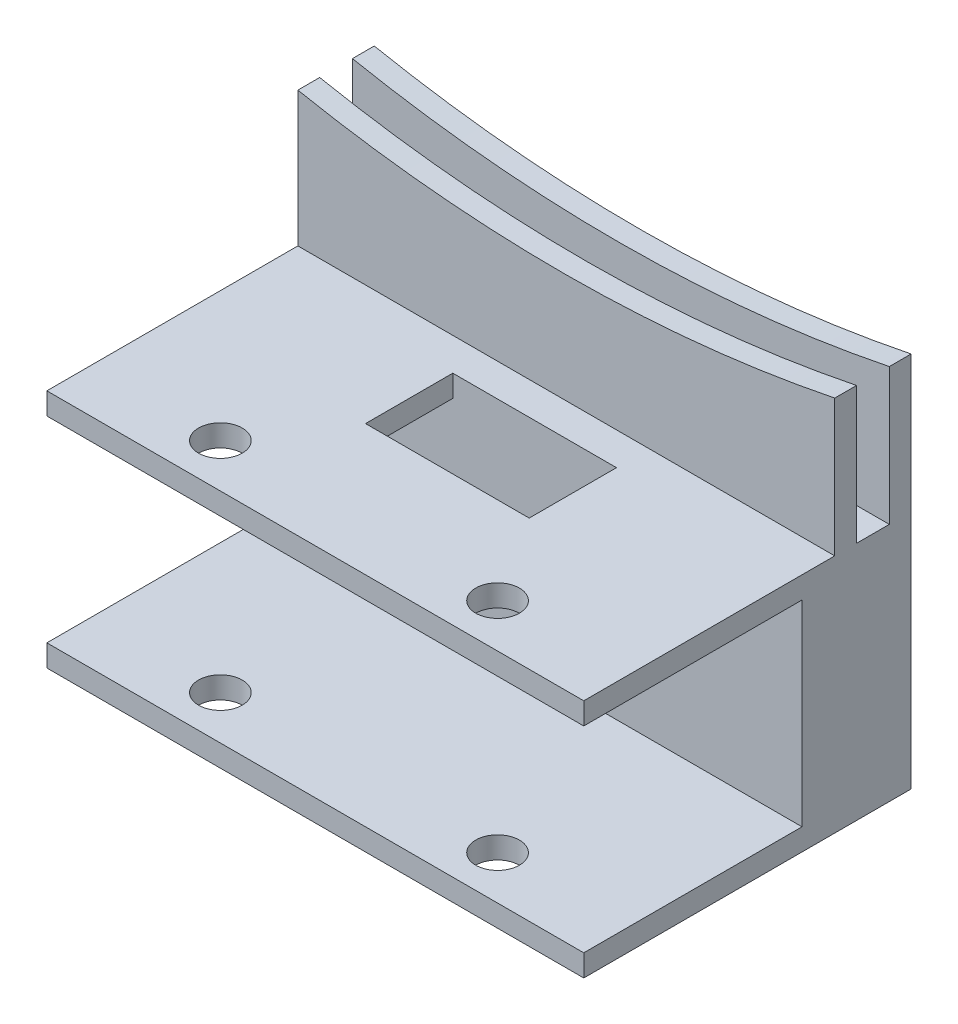
ISO-10303-21;
HEADER;
FILE_DESCRIPTION(('STEP AP214'),'2;1');
FILE_NAME('part.step','',(''),(''),'','','');
FILE_SCHEMA(('AUTOMOTIVE_DESIGN { 1 0 10303 214 1 1 1 1 }'));
ENDSEC;
DATA;
#1=APPLICATION_CONTEXT('core data for automotive mechanical design processes');
#2=APPLICATION_PROTOCOL_DEFINITION('international standard','automotive_design',2000,#1);
#3=PRODUCT_CONTEXT('',#1,'mechanical');
#4=PRODUCT('Part','Part','',(#3));
#5=PRODUCT_RELATED_PRODUCT_CATEGORY('part','',(#4));
#6=PRODUCT_DEFINITION_FORMATION('','',#4);
#7=PRODUCT_DEFINITION_CONTEXT('part definition',#1,'design');
#8=PRODUCT_DEFINITION('design','',#6,#7);
#9=PRODUCT_DEFINITION_SHAPE('','',#8);
#10=(LENGTH_UNIT() NAMED_UNIT(*) SI_UNIT(.MILLI.,.METRE.));
#11=(NAMED_UNIT(*) PLANE_ANGLE_UNIT() SI_UNIT($,.RADIAN.));
#12=(NAMED_UNIT(*) SI_UNIT($,.STERADIAN.) SOLID_ANGLE_UNIT());
#13=UNCERTAINTY_MEASURE_WITH_UNIT(LENGTH_MEASURE(1.E-05),#10,'distance_accuracy_value','');
#14=(GEOMETRIC_REPRESENTATION_CONTEXT(3) GLOBAL_UNCERTAINTY_ASSIGNED_CONTEXT((#13)) GLOBAL_UNIT_ASSIGNED_CONTEXT((#10,
#11,#12)) REPRESENTATION_CONTEXT('',''));
#15=CARTESIAN_POINT('',(0.,0.,0.));
#16=DIRECTION('',(0.,0.,1.));
#17=DIRECTION('',(1.,0.,0.));
#18=AXIS2_PLACEMENT_3D('',#15,#16,#17);
#19=CARTESIAN_POINT('',(-23.6243421052632,22.,9.85197368421053));
#20=DIRECTION('',(0.,0.,-1.));
#21=DIRECTION('',(-1.,0.,0.));
#22=AXIS2_PLACEMENT_3D('',#19,#20,#21);
#23=PLANE('',#22);
#24=DIRECTION('',(0.,-1.,0.));
#25=VECTOR('',#24,1.);
#26=CARTESIAN_POINT('',(25.5756578947368,22.,9.85197368421053));
#27=LINE('',#26,#25);
#28=CARTESIAN_POINT('',(25.5756578947368,2.,9.85197368421053));
#29=VERTEX_POINT('',#28);
#30=CARTESIAN_POINT('',(25.5756578947368,0.,9.85197368421053));
#31=VERTEX_POINT('',#30);
#32=EDGE_CURVE('E245',#29,#31,#27,.T.);
#33=ORIENTED_EDGE('',*,*,#32,.F.);
#34=DIRECTION('',(-1.,0.,0.));
#35=VECTOR('',#34,1.);
#36=CARTESIAN_POINT('',(-23.6243421052632,2.,9.85197368421053));
#37=LINE('',#36,#35);
#38=CARTESIAN_POINT('',(-23.6243421052632,2.,9.85197368421053));
#39=VERTEX_POINT('',#38);
#40=EDGE_CURVE('E11',#29,#39,#37,.T.);
#41=ORIENTED_EDGE('',*,*,#40,.T.);
#42=DIRECTION('',(0.,-1.,0.));
#43=VECTOR('',#42,1.);
#44=CARTESIAN_POINT('',(-23.6243421052632,22.,9.85197368421053));
#45=LINE('',#44,#43);
#46=CARTESIAN_POINT('',(-23.6243421052632,0.,9.85197368421053));
#47=VERTEX_POINT('',#46);
#48=EDGE_CURVE('E260',#39,#47,#45,.T.);
#49=ORIENTED_EDGE('',*,*,#48,.T.);
#50=DIRECTION('',(1.,0.,0.));
#51=VECTOR('',#50,1.);
#52=CARTESIAN_POINT('',(-23.6243421052632,0.,9.85197368421053));
#53=LINE('',#52,#51);
#54=EDGE_CURVE('E254',#47,#31,#53,.T.);
#55=ORIENTED_EDGE('',*,*,#54,.T.);
#56=EDGE_LOOP('',(#33,#41,#49,#55));
#57=FACE_BOUND('',#56,.T.);
#58=ADVANCED_FACE('F33',(#57),#23,.F.);
#59=CARTESIAN_POINT('',(0.,22.,0.));
#60=DIRECTION('',(0.,1.,0.));
#61=DIRECTION('',(0.,0.,1.));
#62=AXIS2_PLACEMENT_3D('',#59,#60,#61);
#63=PLANE('',#62);
#64=DIRECTION('',(0.,0.,1.));
#65=VECTOR('',#64,1.);
#66=CARTESIAN_POINT('',(-23.6243421052632,22.,-20.1480263157895));
#67=LINE('',#66,#65);
#68=CARTESIAN_POINT('',(-23.6243421052632,22.,-18.1480263157895));
#69=VERTEX_POINT('',#68);
#70=CARTESIAN_POINT('',(-23.6243421052632,22.,-15.1480263157895));
#71=VERTEX_POINT('',#70);
#72=EDGE_CURVE('E240',#69,#71,#67,.T.);
#73=ORIENTED_EDGE('',*,*,#72,.T.);
#74=DIRECTION('',(-1.,0.,0.));
#75=VECTOR('',#74,1.);
#76=CARTESIAN_POINT('',(25.5756578947368,22.,-15.1480263157895));
#77=LINE('',#76,#75);
#78=CARTESIAN_POINT('',(25.5756578947368,22.,-15.1480263157895));
#79=VERTEX_POINT('',#78);
#80=EDGE_CURVE('E213',#79,#71,#77,.T.);
#81=ORIENTED_EDGE('',*,*,#80,.F.);
#82=DIRECTION('',(0.,0.,-1.));
#83=VECTOR('',#82,1.);
#84=CARTESIAN_POINT('',(25.5756578947368,22.,-20.1480263157895));
#85=LINE('',#84,#83);
#86=CARTESIAN_POINT('',(25.5756578947368,22.,-18.1480263157895));
#87=VERTEX_POINT('',#86);
#88=EDGE_CURVE('E239',#79,#87,#85,.T.);
#89=ORIENTED_EDGE('',*,*,#88,.T.);
#90=DIRECTION('',(1.,0.,0.));
#91=VECTOR('',#90,1.);
#92=CARTESIAN_POINT('',(-23.6243421052632,22.,-18.1480263157895));
#93=LINE('',#92,#91);
#94=EDGE_CURVE('E227',#69,#87,#93,.T.);
#95=ORIENTED_EDGE('',*,*,#94,.F.);
#96=EDGE_LOOP('',(#73,#81,#89,#95));
#97=FACE_BOUND('',#96,.T.);
#98=ADVANCED_FACE('F340',(#97),#63,.T.);
#99=DIRECTION('',(0.,0.,-1.));
#100=VECTOR('',#99,1.);
#101=CARTESIAN_POINT('',(8.57565789473683,22.,-2.14802631578947));
#102=LINE('',#101,#100);
#103=CARTESIAN_POINT('',(8.57565789473683,22.,-2.14802631578947));
#104=VERTEX_POINT('',#103);
#105=CARTESIAN_POINT('',(8.57565789473683,22.,-10.1480263157895));
#106=VERTEX_POINT('',#105);
#107=EDGE_CURVE('E50',#104,#106,#102,.T.);
#108=ORIENTED_EDGE('',*,*,#107,.F.);
#109=DIRECTION('',(1.,0.,0.));
#110=VECTOR('',#109,1.);
#111=CARTESIAN_POINT('',(8.57565789473683,22.,-2.14802631578947));
#112=LINE('',#111,#110);
#113=CARTESIAN_POINT('',(-6.42434210526317,22.,-2.14802631578947));
#114=VERTEX_POINT('',#113);
#115=EDGE_CURVE('E176',#114,#104,#112,.T.);
#116=ORIENTED_EDGE('',*,*,#115,.F.);
#117=DIRECTION('',(0.,0.,1.));
#118=VECTOR('',#117,1.);
#119=CARTESIAN_POINT('',(-6.42434210526317,22.,-2.14802631578947));
#120=LINE('',#119,#118);
#121=CARTESIAN_POINT('',(-6.42434210526317,22.,-10.1480263157895));
#122=VERTEX_POINT('',#121);
#123=EDGE_CURVE('E418',#122,#114,#120,.T.);
#124=ORIENTED_EDGE('',*,*,#123,.F.);
#125=DIRECTION('',(-1.,0.,0.));
#126=VECTOR('',#125,1.);
#127=CARTESIAN_POINT('',(8.57565789473683,22.,-10.1480263157895));
#128=LINE('',#127,#126);
#129=EDGE_CURVE('E421',#106,#122,#128,.T.);
#130=ORIENTED_EDGE('',*,*,#129,.F.);
#131=EDGE_LOOP('',(#108,#116,#124,#130));
#132=FACE_BOUND('',#131,.T.);
#133=CARTESIAN_POINT('',(-11.7243421052632,22.,5.85197368421052));
#134=DIRECTION('',(0.,-1.,0.));
#135=DIRECTION('',(0.,0.,-1.));
#136=AXIS2_PLACEMENT_3D('',#133,#134,#135);
#137=CIRCLE('',#136,2.);
#138=CARTESIAN_POINT('',(-11.7243421052632,22.,3.85197368421053));
#139=VERTEX_POINT('',#138);
#140=EDGE_CURVE('E432',#139,#139,#137,.T.);
#141=ORIENTED_EDGE('',*,*,#140,.T.);
#142=EDGE_LOOP('',(#141));
#143=FACE_BOUND('',#142,.T.);
#144=CARTESIAN_POINT('',(13.6756578947368,22.,5.85197368421052));
#145=DIRECTION('',(0.,-1.,0.));
#146=DIRECTION('',(0.,0.,-1.));
#147=AXIS2_PLACEMENT_3D('',#144,#145,#146);
#148=CIRCLE('',#147,2.);
#149=CARTESIAN_POINT('',(13.6756578947368,22.,3.85197368421052));
#150=VERTEX_POINT('',#149);
#151=EDGE_CURVE('E272',#150,#150,#148,.T.);
#152=ORIENTED_EDGE('',*,*,#151,.T.);
#153=EDGE_LOOP('',(#152));
#154=FACE_BOUND('',#153,.T.);
#155=CARTESIAN_POINT('',(25.5756578947368,22.,9.85197368421053));
#156=VERTEX_POINT('',#155);
#157=CARTESIAN_POINT('',(25.5756578947368,22.,-13.1480263157895));
#158=VERTEX_POINT('',#157);
#159=EDGE_CURVE('E235',#156,#158,#85,.T.);
#160=ORIENTED_EDGE('',*,*,#159,.T.);
#161=DIRECTION('',(1.,0.,0.));
#162=VECTOR('',#161,1.);
#163=CARTESIAN_POINT('',(25.5756578947368,22.,-13.1480263157895));
#164=LINE('',#163,#162);
#165=CARTESIAN_POINT('',(-23.6243421052632,22.,-13.1480263157895));
#166=VERTEX_POINT('',#165);
#167=EDGE_CURVE('E216',#166,#158,#164,.T.);
#168=ORIENTED_EDGE('',*,*,#167,.F.);
#169=CARTESIAN_POINT('',(-23.6243421052632,22.,9.85197368421053));
#170=VERTEX_POINT('',#169);
#171=EDGE_CURVE('E238',#166,#170,#67,.T.);
#172=ORIENTED_EDGE('',*,*,#171,.T.);
#173=DIRECTION('',(1.,0.,0.));
#174=VECTOR('',#173,1.);
#175=CARTESIAN_POINT('',(-23.6243421052632,22.,9.85197368421053));
#176=LINE('',#175,#174);
#177=EDGE_CURVE('E243',#170,#156,#176,.T.);
#178=ORIENTED_EDGE('',*,*,#177,.T.);
#179=EDGE_LOOP('',(#160,#168,#172,#178));
#180=FACE_BOUND('',#179,.T.);
#181=ADVANCED_FACE('F323',(#132,#143,#154,#180),#63,.T.);
#182=CARTESIAN_POINT('',(25.5756578947368,22.,-20.1480263157895));
#183=DIRECTION('',(-1.,0.,0.));
#184=DIRECTION('',(0.,0.,1.));
#185=AXIS2_PLACEMENT_3D('',#182,#183,#184);
#186=PLANE('',#185);
#187=DIRECTION('',(0.,-1.,0.));
#188=VECTOR('',#187,1.);
#189=CARTESIAN_POINT('',(25.5756578947368,22.,-10.1480263157895));
#190=LINE('',#189,#188);
#191=CARTESIAN_POINT('',(25.5756578947368,20.,-10.1480263157895));
#192=VERTEX_POINT('',#191);
#193=CARTESIAN_POINT('',(25.5756578947368,2.,-10.1480263157895));
#194=VERTEX_POINT('',#193);
#195=EDGE_CURVE('E181',#192,#194,#190,.T.);
#196=ORIENTED_EDGE('',*,*,#195,.T.);
#197=DIRECTION('',(0.,0.,1.));
#198=VECTOR('',#197,1.);
#199=CARTESIAN_POINT('',(25.5756578947368,2.,-20.1480263157895));
#200=LINE('',#199,#198);
#201=EDGE_CURVE('E191',#194,#29,#200,.T.);
#202=ORIENTED_EDGE('',*,*,#201,.T.);
#203=ORIENTED_EDGE('',*,*,#32,.T.);
#204=DIRECTION('',(0.,0.,-1.));
#205=VECTOR('',#204,1.);
#206=CARTESIAN_POINT('',(25.5756578947368,0.,-20.1480263157895));
#207=LINE('',#206,#205);
#208=CARTESIAN_POINT('',(25.5756578947368,0.,-20.1480263157895));
#209=VERTEX_POINT('',#208);
#210=EDGE_CURVE('E234',#31,#209,#207,.T.);
#211=ORIENTED_EDGE('',*,*,#210,.T.);
#212=DIRECTION('',(0.,-1.,0.));
#213=VECTOR('',#212,1.);
#214=CARTESIAN_POINT('',(25.5756578947368,22.,-20.1480263157895));
#215=LINE('',#214,#213);
#216=CARTESIAN_POINT('',(25.5756578947368,34.5255128608411,-20.1480263157895));
#217=VERTEX_POINT('',#216);
#218=EDGE_CURVE('E266',#217,#209,#215,.T.);
#219=ORIENTED_EDGE('',*,*,#218,.F.);
#220=DIRECTION('',(0.,0.,-1.));
#221=VECTOR('',#220,1.);
#222=CARTESIAN_POINT('',(25.5756578947368,34.5255128608411,-13.1480263157895));
#223=LINE('',#222,#221);
#224=CARTESIAN_POINT('',(25.5756578947368,34.5255128608411,-18.1480263157895));
#225=VERTEX_POINT('',#224);
#226=EDGE_CURVE('E204',#225,#217,#223,.T.);
#227=ORIENTED_EDGE('',*,*,#226,.F.);
#228=DIRECTION('',(0.,-1.,0.));
#229=VECTOR('',#228,1.);
#230=CARTESIAN_POINT('',(25.5756578947368,42.,-18.1480263157895));
#231=LINE('',#230,#229);
#232=EDGE_CURVE('E230',#225,#87,#231,.T.);
#233=ORIENTED_EDGE('',*,*,#232,.T.);
#234=ORIENTED_EDGE('',*,*,#88,.F.);
#235=DIRECTION('',(0.,-1.,0.));
#236=VECTOR('',#235,1.);
#237=CARTESIAN_POINT('',(25.5756578947368,42.,-15.1480263157895));
#238=LINE('',#237,#236);
#239=CARTESIAN_POINT('',(25.5756578947368,34.5255128608411,-15.1480263157895));
#240=VERTEX_POINT('',#239);
#241=EDGE_CURVE('E225',#240,#79,#238,.T.);
#242=ORIENTED_EDGE('',*,*,#241,.F.);
#243=CARTESIAN_POINT('',(25.5756578947368,34.5255128608411,-13.1480263157895));
#244=VERTEX_POINT('',#243);
#245=EDGE_CURVE('E201',#244,#240,#223,.T.);
#246=ORIENTED_EDGE('',*,*,#245,.F.);
#247=DIRECTION('',(0.,-1.,0.));
#248=VECTOR('',#247,1.);
#249=CARTESIAN_POINT('',(25.5756578947368,42.,-13.1480263157895));
#250=LINE('',#249,#248);
#251=EDGE_CURVE('E219',#244,#158,#250,.T.);
#252=ORIENTED_EDGE('',*,*,#251,.T.);
#253=ORIENTED_EDGE('',*,*,#159,.F.);
#254=CARTESIAN_POINT('',(25.5756578947368,20.,9.85197368421053));
#255=VERTEX_POINT('',#254);
#256=EDGE_CURVE('E257',#156,#255,#27,.T.);
#257=ORIENTED_EDGE('',*,*,#256,.T.);
#258=DIRECTION('',(0.,0.,-1.));
#259=VECTOR('',#258,1.);
#260=CARTESIAN_POINT('',(25.5756578947368,20.,-20.1480263157895));
#261=LINE('',#260,#259);
#262=EDGE_CURVE('E185',#255,#192,#261,.T.);
#263=ORIENTED_EDGE('',*,*,#262,.T.);
#264=EDGE_LOOP('',(#196,#202,#203,#211,#219,#227,#233,#234,#242,#246,#252,#253,#257,#263));
#265=FACE_BOUND('',#264,.T.);
#266=ADVANCED_FACE('F35',(#265),#186,.F.);
#267=CARTESIAN_POINT('',(-23.6243421052632,22.,-20.1480263157895));
#268=DIRECTION('',(0.,0.,1.));
#269=DIRECTION('',(1.,0.,0.));
#270=AXIS2_PLACEMENT_3D('',#267,#268,#269);
#271=PLANE('',#270);
#272=DIRECTION('',(0.,-1.,0.));
#273=VECTOR('',#272,1.);
#274=CARTESIAN_POINT('',(-23.6243421052632,22.,-20.1480263157895));
#275=LINE('',#274,#273);
#276=CARTESIAN_POINT('',(-23.6243421052632,34.3649316060043,-20.1480263157895));
#277=VERTEX_POINT('',#276);
#278=CARTESIAN_POINT('',(-23.6243421052632,0.,-20.1480263157895));
#279=VERTEX_POINT('',#278);
#280=EDGE_CURVE('E264',#277,#279,#275,.T.);
#281=ORIENTED_EDGE('',*,*,#280,.F.);
#282=CARTESIAN_POINT('',(0.57565789473683,157.,-20.1480263157895));
#283=DIRECTION('',(0.,0.,-1.));
#284=DIRECTION('',(1.,0.,0.));
#285=AXIS2_PLACEMENT_3D('',#282,#283,#284);
#286=CIRCLE('',#285,125.);
#287=EDGE_CURVE('E195',#217,#277,#286,.T.);
#288=ORIENTED_EDGE('',*,*,#287,.F.);
#289=ORIENTED_EDGE('',*,*,#218,.T.);
#290=DIRECTION('',(-1.,0.,0.));
#291=VECTOR('',#290,1.);
#292=CARTESIAN_POINT('',(-23.6243421052632,0.,-20.1480263157895));
#293=LINE('',#292,#291);
#294=EDGE_CURVE('E248',#209,#279,#293,.T.);
#295=ORIENTED_EDGE('',*,*,#294,.T.);
#296=EDGE_LOOP('',(#281,#288,#289,#295));
#297=FACE_BOUND('',#296,.T.);
#298=ADVANCED_FACE('F351',(#297),#271,.F.);
#299=CARTESIAN_POINT('',(-23.6243421052632,22.,-20.1480263157895));
#300=DIRECTION('',(1.,0.,0.));
#301=DIRECTION('',(0.,0.,-1.));
#302=AXIS2_PLACEMENT_3D('',#299,#300,#301);
#303=PLANE('',#302);
#304=ORIENTED_EDGE('',*,*,#48,.F.);
#305=DIRECTION('',(0.,0.,1.));
#306=VECTOR('',#305,1.);
#307=CARTESIAN_POINT('',(-23.6243421052632,2.,9.85197368421053));
#308=LINE('',#307,#306);
#309=CARTESIAN_POINT('',(-23.6243421052632,2.,-10.1480263157895));
#310=VERTEX_POINT('',#309);
#311=EDGE_CURVE('E187',#310,#39,#308,.T.);
#312=ORIENTED_EDGE('',*,*,#311,.F.);
#313=DIRECTION('',(0.,-1.,0.));
#314=VECTOR('',#313,1.);
#315=CARTESIAN_POINT('',(-23.6243421052632,2.,-10.1480263157895));
#316=LINE('',#315,#314);
#317=CARTESIAN_POINT('',(-23.6243421052632,20.,-10.1480263157895));
#318=VERTEX_POINT('',#317);
#319=EDGE_CURVE('E291',#318,#310,#316,.T.);
#320=ORIENTED_EDGE('',*,*,#319,.F.);
#321=DIRECTION('',(0.,0.,-1.));
#322=VECTOR('',#321,1.);
#323=CARTESIAN_POINT('',(-23.6243421052632,20.,9.85197368421053));
#324=LINE('',#323,#322);
#325=CARTESIAN_POINT('',(-23.6243421052632,20.,9.85197368421053));
#326=VERTEX_POINT('',#325);
#327=EDGE_CURVE('E276',#326,#318,#324,.T.);
#328=ORIENTED_EDGE('',*,*,#327,.F.);
#329=EDGE_CURVE('E261',#170,#326,#45,.T.);
#330=ORIENTED_EDGE('',*,*,#329,.F.);
#331=ORIENTED_EDGE('',*,*,#171,.F.);
#332=DIRECTION('',(0.,-1.,0.));
#333=VECTOR('',#332,1.);
#334=CARTESIAN_POINT('',(-23.6243421052632,42.,-13.1480263157895));
#335=LINE('',#334,#333);
#336=CARTESIAN_POINT('',(-23.6243421052632,34.3649316060043,-13.1480263157895));
#337=VERTEX_POINT('',#336);
#338=EDGE_CURVE('E221',#337,#166,#335,.T.);
#339=ORIENTED_EDGE('',*,*,#338,.F.);
#340=DIRECTION('',(0.,0.,-1.));
#341=VECTOR('',#340,1.);
#342=CARTESIAN_POINT('',(-23.6243421052632,34.3649316060043,-13.1480263157895));
#343=LINE('',#342,#341);
#344=CARTESIAN_POINT('',(-23.6243421052632,34.3649316060043,-15.1480263157895));
#345=VERTEX_POINT('',#344);
#346=EDGE_CURVE('E205',#337,#345,#343,.T.);
#347=ORIENTED_EDGE('',*,*,#346,.T.);
#348=DIRECTION('',(0.,-1.,0.));
#349=VECTOR('',#348,1.);
#350=CARTESIAN_POINT('',(-23.6243421052632,42.,-15.1480263157895));
#351=LINE('',#350,#349);
#352=EDGE_CURVE('E223',#345,#71,#351,.T.);
#353=ORIENTED_EDGE('',*,*,#352,.T.);
#354=ORIENTED_EDGE('',*,*,#72,.F.);
#355=DIRECTION('',(0.,-1.,0.));
#356=VECTOR('',#355,1.);
#357=CARTESIAN_POINT('',(-23.6243421052632,42.,-18.1480263157895));
#358=LINE('',#357,#356);
#359=CARTESIAN_POINT('',(-23.6243421052632,34.3649316060043,-18.1480263157895));
#360=VERTEX_POINT('',#359);
#361=EDGE_CURVE('E232',#360,#69,#358,.T.);
#362=ORIENTED_EDGE('',*,*,#361,.F.);
#363=EDGE_CURVE('E199',#360,#277,#343,.T.);
#364=ORIENTED_EDGE('',*,*,#363,.T.);
#365=ORIENTED_EDGE('',*,*,#280,.T.);
#366=DIRECTION('',(0.,0.,1.));
#367=VECTOR('',#366,1.);
#368=CARTESIAN_POINT('',(-23.6243421052632,0.,-20.1480263157895));
#369=LINE('',#368,#367);
#370=EDGE_CURVE('E251',#279,#47,#369,.T.);
#371=ORIENTED_EDGE('',*,*,#370,.T.);
#372=EDGE_LOOP('',(#304,#312,#320,#328,#330,#331,#339,#347,#353,#354,#362,#364,#365,#371));
#373=FACE_BOUND('',#372,.T.);
#374=ADVANCED_FACE('F301',(#373),#303,.F.);
#375=ORIENTED_EDGE('',*,*,#329,.T.);
#376=DIRECTION('',(1.,0.,0.));
#377=VECTOR('',#376,1.);
#378=CARTESIAN_POINT('',(-23.6243421052632,20.,9.85197368421053));
#379=LINE('',#378,#377);
#380=EDGE_CURVE('E42',#326,#255,#379,.T.);
#381=ORIENTED_EDGE('',*,*,#380,.T.);
#382=ORIENTED_EDGE('',*,*,#256,.F.);
#383=ORIENTED_EDGE('',*,*,#177,.F.);
#384=EDGE_LOOP('',(#375,#381,#382,#383));
#385=FACE_BOUND('',#384,.T.);
#386=ADVANCED_FACE('F319',(#385),#23,.F.);
#387=CARTESIAN_POINT('',(0.,0.,0.));
#388=DIRECTION('',(0.,1.,0.));
#389=DIRECTION('',(0.,0.,1.));
#390=AXIS2_PLACEMENT_3D('',#387,#388,#389);
#391=PLANE('',#390);
#392=CARTESIAN_POINT('',(-11.7243421052632,0.,5.85197368421052));
#393=DIRECTION('',(0.,-1.,0.));
#394=DIRECTION('',(0.,0.,-1.));
#395=AXIS2_PLACEMENT_3D('',#392,#393,#394);
#396=CIRCLE('',#395,2.);
#397=CARTESIAN_POINT('',(-11.7243421052632,0.,3.85197368421053));
#398=VERTEX_POINT('',#397);
#399=EDGE_CURVE('E429',#398,#398,#396,.T.);
#400=ORIENTED_EDGE('',*,*,#399,.F.);
#401=EDGE_LOOP('',(#400));
#402=FACE_BOUND('',#401,.T.);
#403=CARTESIAN_POINT('',(13.6756578947368,0.,5.85197368421052));
#404=DIRECTION('',(0.,-1.,0.));
#405=DIRECTION('',(0.,0.,-1.));
#406=AXIS2_PLACEMENT_3D('',#403,#404,#405);
#407=CIRCLE('',#406,2.);
#408=CARTESIAN_POINT('',(13.6756578947368,0.,3.85197368421052));
#409=VERTEX_POINT('',#408);
#410=EDGE_CURVE('E279',#409,#409,#407,.T.);
#411=ORIENTED_EDGE('',*,*,#410,.F.);
#412=EDGE_LOOP('',(#411));
#413=FACE_BOUND('',#412,.T.);
#414=ORIENTED_EDGE('',*,*,#210,.F.);
#415=ORIENTED_EDGE('',*,*,#54,.F.);
#416=ORIENTED_EDGE('',*,*,#370,.F.);
#417=ORIENTED_EDGE('',*,*,#294,.F.);
#418=EDGE_LOOP('',(#414,#415,#416,#417));
#419=FACE_BOUND('',#418,.T.);
#420=ADVANCED_FACE('F309',(#402,#413,#419),#391,.F.);
#421=CARTESIAN_POINT('',(-23.6243421052632,42.,-18.1480263157895));
#422=DIRECTION('',(0.,0.,-1.));
#423=DIRECTION('',(-1.,0.,0.));
#424=AXIS2_PLACEMENT_3D('',#421,#422,#423);
#425=PLANE('',#424);
#426=ORIENTED_EDGE('',*,*,#232,.F.);
#427=CARTESIAN_POINT('',(0.57565789473683,157.,-18.1480263157895));
#428=DIRECTION('',(0.,0.,-1.));
#429=DIRECTION('',(-1.,0.,0.));
#430=AXIS2_PLACEMENT_3D('',#427,#428,#429);
#431=CIRCLE('',#430,125.);
#432=EDGE_CURVE('E210',#225,#360,#431,.T.);
#433=ORIENTED_EDGE('',*,*,#432,.T.);
#434=ORIENTED_EDGE('',*,*,#361,.T.);
#435=ORIENTED_EDGE('',*,*,#94,.T.);
#436=EDGE_LOOP('',(#426,#433,#434,#435));
#437=FACE_BOUND('',#436,.T.);
#438=ADVANCED_FACE('F346',(#437),#425,.F.);
#439=CARTESIAN_POINT('',(25.5756578947368,42.,-15.1480263157895));
#440=DIRECTION('',(0.,0.,1.));
#441=DIRECTION('',(1.,0.,0.));
#442=AXIS2_PLACEMENT_3D('',#439,#440,#441);
#443=PLANE('',#442);
#444=ORIENTED_EDGE('',*,*,#352,.F.);
#445=CARTESIAN_POINT('',(0.57565789473683,157.,-15.1480263157895));
#446=DIRECTION('',(0.,0.,1.));
#447=DIRECTION('',(1.,0.,0.));
#448=AXIS2_PLACEMENT_3D('',#445,#446,#447);
#449=CIRCLE('',#448,125.);
#450=EDGE_CURVE('E203',#345,#240,#449,.T.);
#451=ORIENTED_EDGE('',*,*,#450,.T.);
#452=ORIENTED_EDGE('',*,*,#241,.T.);
#453=ORIENTED_EDGE('',*,*,#80,.T.);
#454=EDGE_LOOP('',(#444,#451,#452,#453));
#455=FACE_BOUND('',#454,.T.);
#456=ADVANCED_FACE('F338',(#455),#443,.F.);
#457=CARTESIAN_POINT('',(25.5756578947368,42.,-13.1480263157895));
#458=DIRECTION('',(0.,0.,-1.));
#459=DIRECTION('',(-1.,0.,0.));
#460=AXIS2_PLACEMENT_3D('',#457,#458,#459);
#461=PLANE('',#460);
#462=ORIENTED_EDGE('',*,*,#251,.F.);
#463=CARTESIAN_POINT('',(0.57565789473683,157.,-13.1480263157895));
#464=DIRECTION('',(0.,0.,-1.));
#465=DIRECTION('',(1.,0.,0.));
#466=AXIS2_PLACEMENT_3D('',#463,#464,#465);
#467=CIRCLE('',#466,125.);
#468=EDGE_CURVE('E196',#244,#337,#467,.T.);
#469=ORIENTED_EDGE('',*,*,#468,.T.);
#470=ORIENTED_EDGE('',*,*,#338,.T.);
#471=ORIENTED_EDGE('',*,*,#167,.T.);
#472=EDGE_LOOP('',(#462,#469,#470,#471));
#473=FACE_BOUND('',#472,.T.);
#474=ADVANCED_FACE('F329',(#473),#461,.F.);
#475=CARTESIAN_POINT('',(0.57565789473683,157.,-13.1480263157895));
#476=DIRECTION('',(0.,0.,-1.));
#477=DIRECTION('',(-1.,0.,0.));
#478=AXIS2_PLACEMENT_3D('',#475,#476,#477);
#479=CYLINDRICAL_SURFACE('',#478,125.);
#480=ORIENTED_EDGE('',*,*,#346,.F.);
#481=ORIENTED_EDGE('',*,*,#468,.F.);
#482=ORIENTED_EDGE('',*,*,#245,.T.);
#483=ORIENTED_EDGE('',*,*,#450,.F.);
#484=EDGE_LOOP('',(#480,#481,#482,#483));
#485=FACE_BOUND('',#484,.T.);
#486=ADVANCED_FACE('F332',(#485),#479,.F.);
#487=ORIENTED_EDGE('',*,*,#226,.T.);
#488=ORIENTED_EDGE('',*,*,#287,.T.);
#489=ORIENTED_EDGE('',*,*,#363,.F.);
#490=ORIENTED_EDGE('',*,*,#432,.F.);
#491=EDGE_LOOP('',(#487,#488,#489,#490));
#492=FACE_BOUND('',#491,.T.);
#493=ADVANCED_FACE('F348',(#492),#479,.F.);
#494=CARTESIAN_POINT('',(26.3756578947368,2.,-10.1480263157895));
#495=DIRECTION('',(0.,0.,-1.));
#496=DIRECTION('',(-1.,0.,0.));
#497=AXIS2_PLACEMENT_3D('',#494,#495,#496);
#498=PLANE('',#497);
#499=DIRECTION('',(-1.,0.,0.));
#500=VECTOR('',#499,1.);
#501=CARTESIAN_POINT('',(26.3756578947368,20.,-10.1480263157895));
#502=LINE('',#501,#500);
#503=CARTESIAN_POINT('',(8.57565789473683,20.,-10.1480263157895));
#504=VERTEX_POINT('',#503);
#505=EDGE_CURVE('E173',#192,#504,#502,.T.);
#506=ORIENTED_EDGE('',*,*,#505,.T.);
#507=DIRECTION('',(0.,1.,0.));
#508=VECTOR('',#507,1.);
#509=CARTESIAN_POINT('',(8.57565789473683,20.,-10.1480263157895));
#510=LINE('',#509,#508);
#511=EDGE_CURVE('E158',#504,#106,#510,.T.);
#512=ORIENTED_EDGE('',*,*,#511,.T.);
#513=ORIENTED_EDGE('',*,*,#129,.T.);
#514=DIRECTION('',(0.,1.,0.));
#515=VECTOR('',#514,1.);
#516=CARTESIAN_POINT('',(-6.42434210526317,20.,-10.1480263157895));
#517=LINE('',#516,#515);
#518=CARTESIAN_POINT('',(-6.42434210526316,20.,-10.1480263157895));
#519=VERTEX_POINT('',#518);
#520=EDGE_CURVE('E167',#519,#122,#517,.T.);
#521=ORIENTED_EDGE('',*,*,#520,.F.);
#522=EDGE_CURVE('E183',#519,#318,#502,.T.);
#523=ORIENTED_EDGE('',*,*,#522,.T.);
#524=ORIENTED_EDGE('',*,*,#319,.T.);
#525=DIRECTION('',(-1.,0.,0.));
#526=VECTOR('',#525,1.);
#527=CARTESIAN_POINT('',(26.3756578947368,2.,-10.1480263157895));
#528=LINE('',#527,#526);
#529=EDGE_CURVE('E182',#194,#310,#528,.T.);
#530=ORIENTED_EDGE('',*,*,#529,.F.);
#531=ORIENTED_EDGE('',*,*,#195,.F.);
#532=EDGE_LOOP('',(#506,#512,#513,#521,#523,#524,#530,#531));
#533=FACE_BOUND('',#532,.T.);
#534=ADVANCED_FACE('F178',(#533),#498,.F.);
#535=CARTESIAN_POINT('',(26.3756578947368,2.,9.85197368421053));
#536=DIRECTION('',(0.,-1.,0.));
#537=DIRECTION('',(0.,0.,-1.));
#538=AXIS2_PLACEMENT_3D('',#535,#536,#537);
#539=PLANE('',#538);
#540=CARTESIAN_POINT('',(-11.7243421052632,2.,5.85197368421052));
#541=DIRECTION('',(0.,-1.,0.));
#542=DIRECTION('',(0.,0.,-1.));
#543=AXIS2_PLACEMENT_3D('',#540,#541,#542);
#544=CIRCLE('',#543,2.);
#545=CARTESIAN_POINT('',(-11.7243421052632,2.,3.85197368421053));
#546=VERTEX_POINT('',#545);
#547=EDGE_CURVE('E284',#546,#546,#544,.T.);
#548=ORIENTED_EDGE('',*,*,#547,.T.);
#549=EDGE_LOOP('',(#548));
#550=FACE_BOUND('',#549,.T.);
#551=CARTESIAN_POINT('',(13.6756578947368,2.,5.85197368421052));
#552=DIRECTION('',(0.,-1.,0.));
#553=DIRECTION('',(0.,0.,-1.));
#554=AXIS2_PLACEMENT_3D('',#551,#552,#553);
#555=CIRCLE('',#554,2.);
#556=CARTESIAN_POINT('',(13.6756578947368,2.,3.85197368421052));
#557=VERTEX_POINT('',#556);
#558=EDGE_CURVE('E271',#557,#557,#555,.T.);
#559=ORIENTED_EDGE('',*,*,#558,.T.);
#560=EDGE_LOOP('',(#559));
#561=FACE_BOUND('',#560,.T.);
#562=ORIENTED_EDGE('',*,*,#529,.T.);
#563=ORIENTED_EDGE('',*,*,#311,.T.);
#564=ORIENTED_EDGE('',*,*,#40,.F.);
#565=ORIENTED_EDGE('',*,*,#201,.F.);
#566=EDGE_LOOP('',(#562,#563,#564,#565));
#567=FACE_BOUND('',#566,.T.);
#568=ADVANCED_FACE('F295',(#550,#561,#567),#539,.F.);
#569=CARTESIAN_POINT('',(26.3756578947368,20.,9.85197368421053));
#570=DIRECTION('',(0.,1.,0.));
#571=DIRECTION('',(0.,0.,1.));
#572=AXIS2_PLACEMENT_3D('',#569,#570,#571);
#573=PLANE('',#572);
#574=CARTESIAN_POINT('',(-11.7243421052632,20.,5.85197368421052));
#575=DIRECTION('',(0.,1.,0.));
#576=DIRECTION('',(0.,0.,1.));
#577=AXIS2_PLACEMENT_3D('',#574,#575,#576);
#578=CIRCLE('',#577,2.);
#579=CARTESIAN_POINT('',(-11.7243421052632,20.,7.85197368421052));
#580=VERTEX_POINT('',#579);
#581=EDGE_CURVE('E37',#580,#580,#578,.T.);
#582=ORIENTED_EDGE('',*,*,#581,.T.);
#583=EDGE_LOOP('',(#582));
#584=FACE_BOUND('',#583,.T.);
#585=CARTESIAN_POINT('',(13.6756578947368,20.,5.85197368421052));
#586=DIRECTION('',(0.,1.,0.));
#587=DIRECTION('',(0.,0.,1.));
#588=AXIS2_PLACEMENT_3D('',#585,#586,#587);
#589=CIRCLE('',#588,2.);
#590=CARTESIAN_POINT('',(13.6756578947368,20.,7.85197368421053));
#591=VERTEX_POINT('',#590);
#592=EDGE_CURVE('E269',#591,#591,#589,.T.);
#593=ORIENTED_EDGE('',*,*,#592,.T.);
#594=EDGE_LOOP('',(#593));
#595=FACE_BOUND('',#594,.T.);
#596=DIRECTION('',(1.,0.,0.));
#597=VECTOR('',#596,1.);
#598=CARTESIAN_POINT('',(8.57565789473683,20.,-2.14802631578947));
#599=LINE('',#598,#597);
#600=CARTESIAN_POINT('',(-6.42434210526317,20.,-2.14802631578947));
#601=VERTEX_POINT('',#600);
#602=CARTESIAN_POINT('',(8.57565789473683,20.,-2.14802631578947));
#603=VERTEX_POINT('',#602);
#604=EDGE_CURVE('E168',#601,#603,#599,.T.);
#605=ORIENTED_EDGE('',*,*,#604,.T.);
#606=DIRECTION('',(0.,0.,-1.));
#607=VECTOR('',#606,1.);
#608=CARTESIAN_POINT('',(8.57565789473683,20.,-2.14802631578947));
#609=LINE('',#608,#607);
#610=EDGE_CURVE('E161',#603,#504,#609,.T.);
#611=ORIENTED_EDGE('',*,*,#610,.T.);
#612=ORIENTED_EDGE('',*,*,#505,.F.);
#613=ORIENTED_EDGE('',*,*,#262,.F.);
#614=ORIENTED_EDGE('',*,*,#380,.F.);
#615=ORIENTED_EDGE('',*,*,#327,.T.);
#616=ORIENTED_EDGE('',*,*,#522,.F.);
#617=DIRECTION('',(0.,0.,1.));
#618=VECTOR('',#617,1.);
#619=CARTESIAN_POINT('',(-6.42434210526317,20.,-2.14802631578947));
#620=LINE('',#619,#618);
#621=EDGE_CURVE('E58',#519,#601,#620,.T.);
#622=ORIENTED_EDGE('',*,*,#621,.T.);
#623=EDGE_LOOP('',(#605,#611,#612,#613,#614,#615,#616,#622));
#624=FACE_BOUND('',#623,.T.);
#625=ADVANCED_FACE('F172',(#584,#595,#624),#573,.F.);
#626=CARTESIAN_POINT('',(13.6756578947368,22.,5.85197368421052));
#627=DIRECTION('',(0.,-1.,0.));
#628=DIRECTION('',(0.,0.,-1.));
#629=AXIS2_PLACEMENT_3D('',#626,#627,#628);
#630=CYLINDRICAL_SURFACE('',#629,2.);
#631=ORIENTED_EDGE('',*,*,#151,.F.);
#632=EDGE_LOOP('',(#631));
#633=FACE_BOUND('',#632,.T.);
#634=ORIENTED_EDGE('',*,*,#592,.F.);
#635=EDGE_LOOP('',(#634));
#636=FACE_BOUND('',#635,.T.);
#637=ADVANCED_FACE('F385',(#633,#636),#630,.F.);
#638=ORIENTED_EDGE('',*,*,#410,.T.);
#639=EDGE_LOOP('',(#638));
#640=FACE_BOUND('',#639,.T.);
#641=ORIENTED_EDGE('',*,*,#558,.F.);
#642=EDGE_LOOP('',(#641));
#643=FACE_BOUND('',#642,.T.);
#644=ADVANCED_FACE('F392',(#640,#643),#630,.F.);
#645=CARTESIAN_POINT('',(-11.7243421052632,22.,5.85197368421052));
#646=DIRECTION('',(0.,-1.,0.));
#647=DIRECTION('',(0.,0.,-1.));
#648=AXIS2_PLACEMENT_3D('',#645,#646,#647);
#649=CYLINDRICAL_SURFACE('',#648,2.);
#650=ORIENTED_EDGE('',*,*,#140,.F.);
#651=EDGE_LOOP('',(#650));
#652=FACE_BOUND('',#651,.T.);
#653=ORIENTED_EDGE('',*,*,#581,.F.);
#654=EDGE_LOOP('',(#653));
#655=FACE_BOUND('',#654,.T.);
#656=ADVANCED_FACE('F395',(#652,#655),#649,.F.);
#657=ORIENTED_EDGE('',*,*,#399,.T.);
#658=EDGE_LOOP('',(#657));
#659=FACE_BOUND('',#658,.T.);
#660=ORIENTED_EDGE('',*,*,#547,.F.);
#661=EDGE_LOOP('',(#660));
#662=FACE_BOUND('',#661,.T.);
#663=ADVANCED_FACE('F397',(#659,#662),#649,.F.);
#664=CARTESIAN_POINT('',(8.57565789473683,20.,-2.14802631578947));
#665=DIRECTION('',(1.,0.,0.));
#666=DIRECTION('',(0.,0.,-1.));
#667=AXIS2_PLACEMENT_3D('',#664,#665,#666);
#668=PLANE('',#667);
#669=ORIENTED_EDGE('',*,*,#107,.T.);
#670=ORIENTED_EDGE('',*,*,#511,.F.);
#671=ORIENTED_EDGE('',*,*,#610,.F.);
#672=DIRECTION('',(0.,1.,0.));
#673=VECTOR('',#672,1.);
#674=CARTESIAN_POINT('',(8.57565789473683,20.,-2.14802631578947));
#675=LINE('',#674,#673);
#676=EDGE_CURVE('E413',#603,#104,#675,.T.);
#677=ORIENTED_EDGE('',*,*,#676,.T.);
#678=EDGE_LOOP('',(#669,#670,#671,#677));
#679=FACE_BOUND('',#678,.T.);
#680=ADVANCED_FACE('F160',(#679),#668,.F.);
#681=CARTESIAN_POINT('',(8.57565789473683,20.,-2.14802631578947));
#682=DIRECTION('',(0.,0.,1.));
#683=DIRECTION('',(1.,0.,0.));
#684=AXIS2_PLACEMENT_3D('',#681,#682,#683);
#685=PLANE('',#684);
#686=ORIENTED_EDGE('',*,*,#115,.T.);
#687=ORIENTED_EDGE('',*,*,#676,.F.);
#688=ORIENTED_EDGE('',*,*,#604,.F.);
#689=DIRECTION('',(0.,1.,0.));
#690=VECTOR('',#689,1.);
#691=CARTESIAN_POINT('',(-6.42434210526317,20.,-2.14802631578947));
#692=LINE('',#691,#690);
#693=EDGE_CURVE('E414',#601,#114,#692,.T.);
#694=ORIENTED_EDGE('',*,*,#693,.T.);
#695=EDGE_LOOP('',(#686,#687,#688,#694));
#696=FACE_BOUND('',#695,.T.);
#697=ADVANCED_FACE('F403',(#696),#685,.F.);
#698=CARTESIAN_POINT('',(-6.42434210526317,20.,-2.14802631578947));
#699=DIRECTION('',(-1.,0.,0.));
#700=DIRECTION('',(0.,0.,1.));
#701=AXIS2_PLACEMENT_3D('',#698,#699,#700);
#702=PLANE('',#701);
#703=ORIENTED_EDGE('',*,*,#123,.T.);
#704=ORIENTED_EDGE('',*,*,#693,.F.);
#705=ORIENTED_EDGE('',*,*,#621,.F.);
#706=ORIENTED_EDGE('',*,*,#520,.T.);
#707=EDGE_LOOP('',(#703,#704,#705,#706));
#708=FACE_BOUND('',#707,.T.);
#709=ADVANCED_FACE('F404',(#708),#702,.F.);
#710=CLOSED_SHELL('',(#58,#98,#181,#266,#298,#374,#386,#420,#438,#456,#474,#486,#493,#534,#568,
#625,#637,#644,#656,#663,#680,#697,#709));
#711=MANIFOLD_SOLID_BREP('B2',#710);
#712=ADVANCED_BREP_SHAPE_REPRESENTATION('',(#18,#711),#14);
#713=SHAPE_DEFINITION_REPRESENTATION(#9,#712);
ENDSEC;
END-ISO-10303-21;
